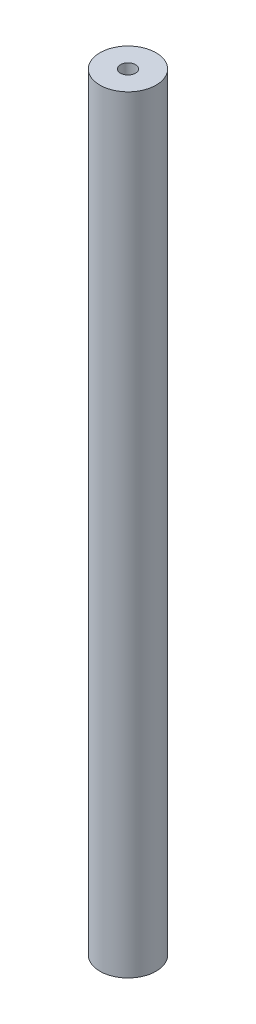
ISO-10303-21;
HEADER;
FILE_DESCRIPTION(('STEP AP214'),'2;1');
FILE_NAME('part.step','',(''),(''),'','','');
FILE_SCHEMA(('AUTOMOTIVE_DESIGN { 1 0 10303 214 1 1 1 1 }'));
ENDSEC;
DATA;
#1=APPLICATION_CONTEXT('core data for automotive mechanical design processes');
#2=APPLICATION_PROTOCOL_DEFINITION('international standard','automotive_design',2000,#1);
#3=PRODUCT_CONTEXT('',#1,'mechanical');
#4=PRODUCT('Part','Part','',(#3));
#5=PRODUCT_RELATED_PRODUCT_CATEGORY('part','',(#4));
#6=PRODUCT_DEFINITION_FORMATION('','',#4);
#7=PRODUCT_DEFINITION_CONTEXT('part definition',#1,'design');
#8=PRODUCT_DEFINITION('design','',#6,#7);
#9=PRODUCT_DEFINITION_SHAPE('','',#8);
#10=(LENGTH_UNIT() NAMED_UNIT(*) SI_UNIT(.MILLI.,.METRE.));
#11=(NAMED_UNIT(*) PLANE_ANGLE_UNIT() SI_UNIT($,.RADIAN.));
#12=(NAMED_UNIT(*) SI_UNIT($,.STERADIAN.) SOLID_ANGLE_UNIT());
#13=UNCERTAINTY_MEASURE_WITH_UNIT(LENGTH_MEASURE(1.E-05),#10,'distance_accuracy_value','');
#14=(GEOMETRIC_REPRESENTATION_CONTEXT(3) GLOBAL_UNCERTAINTY_ASSIGNED_CONTEXT((#13)) GLOBAL_UNIT_ASSIGNED_CONTEXT((#10,
#11,#12)) REPRESENTATION_CONTEXT('',''));
#15=CARTESIAN_POINT('',(0.,0.,0.));
#16=DIRECTION('',(0.,0.,1.));
#17=DIRECTION('',(1.,0.,0.));
#18=AXIS2_PLACEMENT_3D('',#15,#16,#17);
#19=CARTESIAN_POINT('',(0.,102.5,0.));
#20=DIRECTION('',(0.,-1.,0.));
#21=DIRECTION('',(0.,0.,-1.));
#22=AXIS2_PLACEMENT_3D('',#19,#20,#21);
#23=CYLINDRICAL_SURFACE('',#22,7.5);
#24=CARTESIAN_POINT('',(0.,102.5,0.));
#25=DIRECTION('',(0.,1.,0.));
#26=DIRECTION('',(0.,0.,1.));
#27=AXIS2_PLACEMENT_3D('',#24,#25,#26);
#28=CIRCLE('',#27,7.5);
#29=CARTESIAN_POINT('',(0.,102.5,7.5));
#30=VERTEX_POINT('',#29);
#31=EDGE_CURVE('E10',#30,#30,#28,.T.);
#32=ORIENTED_EDGE('',*,*,#31,.F.);
#33=EDGE_LOOP('',(#32));
#34=FACE_BOUND('',#33,.T.);
#35=CARTESIAN_POINT('',(0.,-102.5,0.));
#36=DIRECTION('',(0.,1.,0.));
#37=DIRECTION('',(0.,0.,1.));
#38=AXIS2_PLACEMENT_3D('',#35,#36,#37);
#39=CIRCLE('',#38,7.5);
#40=CARTESIAN_POINT('',(0.,-102.5,7.5));
#41=VERTEX_POINT('',#40);
#42=EDGE_CURVE('E33',#41,#41,#39,.T.);
#43=ORIENTED_EDGE('',*,*,#42,.T.);
#44=EDGE_LOOP('',(#43));
#45=FACE_BOUND('',#44,.T.);
#46=ADVANCED_FACE('F30',(#34,#45),#23,.T.);
#47=CARTESIAN_POINT('',(0.,102.5,0.));
#48=DIRECTION('',(0.,1.,0.));
#49=DIRECTION('',(0.,0.,1.));
#50=AXIS2_PLACEMENT_3D('',#47,#48,#49);
#51=PLANE('',#50);
#52=CARTESIAN_POINT('',(0.,102.5,0.));
#53=DIRECTION('',(0.,1.,0.));
#54=DIRECTION('',(0.,0.,1.));
#55=AXIS2_PLACEMENT_3D('',#52,#53,#54);
#56=CIRCLE('',#55,2.);
#57=CARTESIAN_POINT('',(0.,102.5,2.));
#58=VERTEX_POINT('',#57);
#59=EDGE_CURVE('E42',#58,#58,#56,.T.);
#60=ORIENTED_EDGE('',*,*,#59,.F.);
#61=EDGE_LOOP('',(#60));
#62=FACE_BOUND('',#61,.T.);
#63=ORIENTED_EDGE('',*,*,#31,.T.);
#64=EDGE_LOOP('',(#63));
#65=FACE_BOUND('',#64,.T.);
#66=ADVANCED_FACE('F57',(#62,#65),#51,.T.);
#67=CARTESIAN_POINT('',(0.,-102.5,0.));
#68=DIRECTION('',(0.,1.,0.));
#69=DIRECTION('',(0.,0.,1.));
#70=AXIS2_PLACEMENT_3D('',#67,#68,#69);
#71=PLANE('',#70);
#72=ORIENTED_EDGE('',*,*,#42,.F.);
#73=EDGE_LOOP('',(#72));
#74=FACE_BOUND('',#73,.T.);
#75=ADVANCED_FACE('F53',(#74),#71,.F.);
#76=CARTESIAN_POINT('',(0.,87.5,0.));
#77=DIRECTION('',(0.,1.,0.));
#78=DIRECTION('',(0.,0.,1.));
#79=AXIS2_PLACEMENT_3D('',#76,#77,#78);
#80=CYLINDRICAL_SURFACE('',#79,2.);
#81=CARTESIAN_POINT('',(0.,87.5,0.));
#82=DIRECTION('',(0.,1.,0.));
#83=DIRECTION('',(0.,0.,1.));
#84=AXIS2_PLACEMENT_3D('',#81,#82,#83);
#85=CIRCLE('',#84,2.);
#86=CARTESIAN_POINT('',(0.,87.5,2.));
#87=VERTEX_POINT('',#86);
#88=EDGE_CURVE('E40',#87,#87,#85,.T.);
#89=ORIENTED_EDGE('',*,*,#88,.F.);
#90=EDGE_LOOP('',(#89));
#91=FACE_BOUND('',#90,.T.);
#92=ORIENTED_EDGE('',*,*,#59,.T.);
#93=EDGE_LOOP('',(#92));
#94=FACE_BOUND('',#93,.T.);
#95=ADVANCED_FACE('F50',(#91,#94),#80,.F.);
#96=CARTESIAN_POINT('',(0.,87.5,0.));
#97=DIRECTION('',(0.,1.,0.));
#98=DIRECTION('',(0.,0.,1.));
#99=AXIS2_PLACEMENT_3D('',#96,#97,#98);
#100=PLANE('',#99);
#101=ORIENTED_EDGE('',*,*,#88,.T.);
#102=EDGE_LOOP('',(#101));
#103=FACE_BOUND('',#102,.T.);
#104=ADVANCED_FACE('F48',(#103),#100,.T.);
#105=CLOSED_SHELL('',(#46,#66,#75,#95,#104));
#106=MANIFOLD_SOLID_BREP('B2',#105);
#107=ADVANCED_BREP_SHAPE_REPRESENTATION('',(#18,#106),#14);
#108=SHAPE_DEFINITION_REPRESENTATION(#9,#107);
ENDSEC;
END-ISO-10303-21;
